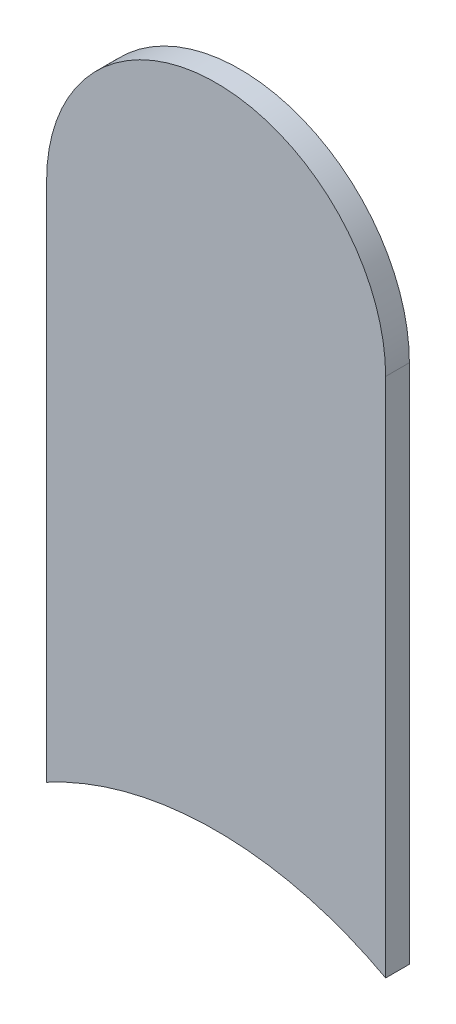
ISO-10303-21;
HEADER;
FILE_DESCRIPTION(('STEP AP214'),'2;1');
FILE_NAME('part.step','',(''),(''),'','','');
FILE_SCHEMA(('AUTOMOTIVE_DESIGN { 1 0 10303 214 1 1 1 1 }'));
ENDSEC;
DATA;
#1=APPLICATION_CONTEXT('core data for automotive mechanical design processes');
#2=APPLICATION_PROTOCOL_DEFINITION('international standard','automotive_design',2000,#1);
#3=PRODUCT_CONTEXT('',#1,'mechanical');
#4=PRODUCT('Part','Part','',(#3));
#5=PRODUCT_RELATED_PRODUCT_CATEGORY('part','',(#4));
#6=PRODUCT_DEFINITION_FORMATION('','',#4);
#7=PRODUCT_DEFINITION_CONTEXT('part definition',#1,'design');
#8=PRODUCT_DEFINITION('design','',#6,#7);
#9=PRODUCT_DEFINITION_SHAPE('','',#8);
#10=(LENGTH_UNIT() NAMED_UNIT(*) SI_UNIT(.MILLI.,.METRE.));
#11=(NAMED_UNIT(*) PLANE_ANGLE_UNIT() SI_UNIT($,.RADIAN.));
#12=(NAMED_UNIT(*) SI_UNIT($,.STERADIAN.) SOLID_ANGLE_UNIT());
#13=UNCERTAINTY_MEASURE_WITH_UNIT(LENGTH_MEASURE(1.E-05),#10,'distance_accuracy_value','');
#14=(GEOMETRIC_REPRESENTATION_CONTEXT(3) GLOBAL_UNCERTAINTY_ASSIGNED_CONTEXT((#13)) GLOBAL_UNIT_ASSIGNED_CONTEXT((#10,
#11,#12)) REPRESENTATION_CONTEXT('',''));
#15=CARTESIAN_POINT('',(0.,0.,0.));
#16=DIRECTION('',(0.,0.,1.));
#17=DIRECTION('',(1.,0.,0.));
#18=AXIS2_PLACEMENT_3D('',#15,#16,#17);
#19=CARTESIAN_POINT('',(134.102,-110.504,-0.035));
#20=DIRECTION('',(1.,0.,0.));
#21=DIRECTION('',(0.,1.,0.));
#22=AXIS2_PLACEMENT_3D('',#19,#20,#21);
#23=PLANE('',#22);
#24=DIRECTION('',(0.,0.,-1.));
#25=VECTOR('',#24,1.);
#26=CARTESIAN_POINT('',(134.102,-111.2723453671,-0.045));
#27=LINE('',#26,#25);
#28=CARTESIAN_POINT('',(134.102,-111.2723453671,0.));
#29=VERTEX_POINT('',#28);
#30=CARTESIAN_POINT('',(134.102,-111.2723453671,-0.035));
#31=VERTEX_POINT('',#30);
#32=EDGE_CURVE('E11',#29,#31,#27,.T.);
#33=ORIENTED_EDGE('',*,*,#32,.F.);
#34=DIRECTION('',(0.,-1.,0.));
#35=VECTOR('',#34,1.);
#36=CARTESIAN_POINT('',(134.102,-110.504,0.));
#37=LINE('',#36,#35);
#38=CARTESIAN_POINT('',(134.102,-110.504,0.));
#39=VERTEX_POINT('',#38);
#40=EDGE_CURVE('E26',#39,#29,#37,.T.);
#41=ORIENTED_EDGE('',*,*,#40,.F.);
#42=DIRECTION('',(0.,0.,1.));
#43=VECTOR('',#42,1.);
#44=CARTESIAN_POINT('',(134.102,-110.504,-0.035));
#45=LINE('',#44,#43);
#46=CARTESIAN_POINT('',(134.102,-110.504,-0.035));
#47=VERTEX_POINT('',#46);
#48=EDGE_CURVE('E60',#47,#39,#45,.T.);
#49=ORIENTED_EDGE('',*,*,#48,.F.);
#50=DIRECTION('',(0.,-1.,0.));
#51=VECTOR('',#50,1.);
#52=CARTESIAN_POINT('',(134.102,-110.504,-0.035));
#53=LINE('',#52,#51);
#54=EDGE_CURVE('E63',#47,#31,#53,.T.);
#55=ORIENTED_EDGE('',*,*,#54,.T.);
#56=EDGE_LOOP('',(#33,#41,#49,#55));
#57=FACE_BOUND('',#56,.T.);
#58=ADVANCED_FACE('F17',(#57),#23,.F.);
#59=CARTESIAN_POINT('',(134.352,-111.734,-0.045));
#60=DIRECTION('',(0.,0.,-1.));
#61=DIRECTION('',(0.,-1.,0.));
#62=AXIS2_PLACEMENT_3D('',#59,#60,#61);
#63=CYLINDRICAL_SURFACE('',#62,0.525);
#64=DIRECTION('',(0.,0.,-1.));
#65=VECTOR('',#64,1.);
#66=CARTESIAN_POINT('',(134.602,-111.2723453671,-0.045));
#67=LINE('',#66,#65);
#68=CARTESIAN_POINT('',(134.602,-111.2723453671,0.));
#69=VERTEX_POINT('',#68);
#70=CARTESIAN_POINT('',(134.602,-111.2723453671,-0.035));
#71=VERTEX_POINT('',#70);
#72=EDGE_CURVE('E90',#69,#71,#67,.T.);
#73=ORIENTED_EDGE('',*,*,#72,.F.);
#74=CARTESIAN_POINT('',(134.352,-111.734,0.));
#75=DIRECTION('',(0.,0.,-1.));
#76=DIRECTION('',(0.,-1.,0.));
#77=AXIS2_PLACEMENT_3D('',#74,#75,#76);
#78=CIRCLE('',#77,0.525);
#79=EDGE_CURVE('E95',#29,#69,#78,.T.);
#80=ORIENTED_EDGE('',*,*,#79,.F.);
#81=ORIENTED_EDGE('',*,*,#32,.T.);
#82=CARTESIAN_POINT('',(134.352,-111.734,-0.035));
#83=DIRECTION('',(0.,0.,-1.));
#84=DIRECTION('',(0.,-1.,0.));
#85=AXIS2_PLACEMENT_3D('',#82,#83,#84);
#86=CIRCLE('',#85,0.525);
#87=EDGE_CURVE('E68',#31,#71,#86,.T.);
#88=ORIENTED_EDGE('',*,*,#87,.T.);
#89=EDGE_LOOP('',(#73,#80,#81,#88));
#90=FACE_BOUND('',#89,.T.);
#91=ADVANCED_FACE('F117',(#90),#63,.F.);
#92=CARTESIAN_POINT('',(134.602,-111.734,0.));
#93=DIRECTION('',(0.,0.,1.));
#94=DIRECTION('',(1.,0.,0.));
#95=AXIS2_PLACEMENT_3D('',#92,#93,#94);
#96=PLANE('',#95);
#97=ORIENTED_EDGE('',*,*,#79,.T.);
#98=DIRECTION('',(0.,1.,0.));
#99=VECTOR('',#98,1.);
#100=CARTESIAN_POINT('',(134.602,-111.734,0.));
#101=LINE('',#100,#99);
#102=CARTESIAN_POINT('',(134.602,-110.504,0.));
#103=VERTEX_POINT('',#102);
#104=EDGE_CURVE('E108',#69,#103,#101,.T.);
#105=ORIENTED_EDGE('',*,*,#104,.T.);
#106=CARTESIAN_POINT('',(134.352,-110.504,0.));
#107=DIRECTION('',(0.,0.,1.));
#108=DIRECTION('',(1.,0.,0.));
#109=AXIS2_PLACEMENT_3D('',#106,#107,#108);
#110=CIRCLE('',#109,0.25);
#111=EDGE_CURVE('E67',#103,#39,#110,.T.);
#112=ORIENTED_EDGE('',*,*,#111,.T.);
#113=ORIENTED_EDGE('',*,*,#40,.T.);
#114=EDGE_LOOP('',(#97,#105,#112,#113));
#115=FACE_BOUND('',#114,.T.);
#116=ADVANCED_FACE('F171',(#115),#96,.T.);
#117=CARTESIAN_POINT('',(134.352,-110.504,-0.035));
#118=DIRECTION('',(0.,0.,-1.));
#119=DIRECTION('',(1.,0.,0.));
#120=AXIS2_PLACEMENT_3D('',#117,#118,#119);
#121=CYLINDRICAL_SURFACE('',#120,0.25);
#122=CARTESIAN_POINT('',(134.352,-110.504,-0.035));
#123=DIRECTION('',(0.,0.,1.));
#124=DIRECTION('',(1.,0.,0.));
#125=AXIS2_PLACEMENT_3D('',#122,#123,#124);
#126=CIRCLE('',#125,0.25);
#127=CARTESIAN_POINT('',(134.602,-110.504,-0.035));
#128=VERTEX_POINT('',#127);
#129=EDGE_CURVE('E72',#128,#47,#126,.T.);
#130=ORIENTED_EDGE('',*,*,#129,.T.);
#131=ORIENTED_EDGE('',*,*,#48,.T.);
#132=ORIENTED_EDGE('',*,*,#111,.F.);
#133=DIRECTION('',(0.,0.,1.));
#134=VECTOR('',#133,1.);
#135=CARTESIAN_POINT('',(134.602,-110.504,-0.035));
#136=LINE('',#135,#134);
#137=EDGE_CURVE('E75',#128,#103,#136,.T.);
#138=ORIENTED_EDGE('',*,*,#137,.F.);
#139=EDGE_LOOP('',(#130,#131,#132,#138));
#140=FACE_BOUND('',#139,.T.);
#141=ADVANCED_FACE('F73',(#140),#121,.T.);
#142=CARTESIAN_POINT('',(134.602,-111.734,-0.035));
#143=DIRECTION('',(0.,0.,1.));
#144=DIRECTION('',(1.,0.,0.));
#145=AXIS2_PLACEMENT_3D('',#142,#143,#144);
#146=PLANE('',#145);
#147=ORIENTED_EDGE('',*,*,#54,.F.);
#148=ORIENTED_EDGE('',*,*,#129,.F.);
#149=DIRECTION('',(0.,1.,0.));
#150=VECTOR('',#149,1.);
#151=CARTESIAN_POINT('',(134.602,-111.734,-0.035));
#152=LINE('',#151,#150);
#153=EDGE_CURVE('E84',#71,#128,#152,.T.);
#154=ORIENTED_EDGE('',*,*,#153,.F.);
#155=ORIENTED_EDGE('',*,*,#87,.F.);
#156=EDGE_LOOP('',(#147,#148,#154,#155));
#157=FACE_BOUND('',#156,.T.);
#158=ADVANCED_FACE('F82',(#157),#146,.F.);
#159=CARTESIAN_POINT('',(134.602,-111.734,-0.035));
#160=DIRECTION('',(-1.,0.,0.));
#161=DIRECTION('',(0.,0.,1.));
#162=AXIS2_PLACEMENT_3D('',#159,#160,#161);
#163=PLANE('',#162);
#164=ORIENTED_EDGE('',*,*,#137,.T.);
#165=ORIENTED_EDGE('',*,*,#104,.F.);
#166=ORIENTED_EDGE('',*,*,#72,.T.);
#167=ORIENTED_EDGE('',*,*,#153,.T.);
#168=EDGE_LOOP('',(#164,#165,#166,#167));
#169=FACE_BOUND('',#168,.T.);
#170=ADVANCED_FACE('F121',(#169),#163,.F.);
#171=CLOSED_SHELL('',(#58,#91,#116,#141,#158,#170));
#172=MANIFOLD_SOLID_BREP('B1',#171);
#173=ADVANCED_BREP_SHAPE_REPRESENTATION('',(#18,#172),#14);
#174=SHAPE_DEFINITION_REPRESENTATION(#9,#173);
ENDSEC;
END-ISO-10303-21;
